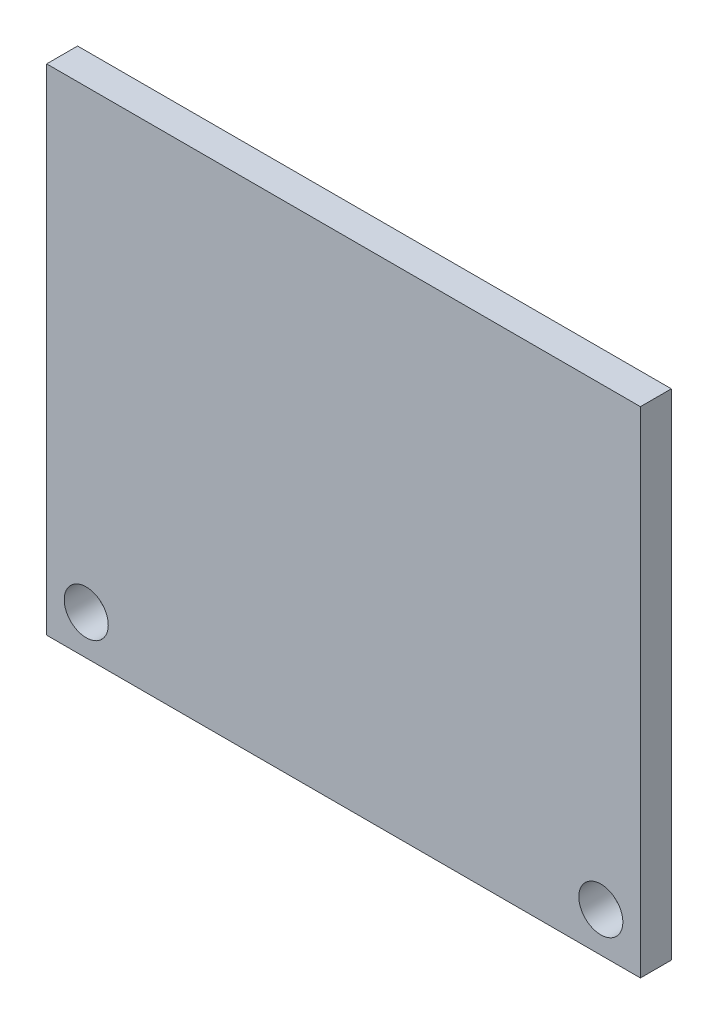
ISO-10303-21;
HEADER;
FILE_DESCRIPTION(('STEP AP214'),'2;1');
FILE_NAME('part.step','',(''),(''),'','','');
FILE_SCHEMA(('AUTOMOTIVE_DESIGN { 1 0 10303 214 1 1 1 1 }'));
ENDSEC;
DATA;
#1=APPLICATION_CONTEXT('core data for automotive mechanical design processes');
#2=APPLICATION_PROTOCOL_DEFINITION('international standard','automotive_design',2000,#1);
#3=PRODUCT_CONTEXT('',#1,'mechanical');
#4=PRODUCT('Part','Part','',(#3));
#5=PRODUCT_RELATED_PRODUCT_CATEGORY('part','',(#4));
#6=PRODUCT_DEFINITION_FORMATION('','',#4);
#7=PRODUCT_DEFINITION_CONTEXT('part definition',#1,'design');
#8=PRODUCT_DEFINITION('design','',#6,#7);
#9=PRODUCT_DEFINITION_SHAPE('','',#8);
#10=(LENGTH_UNIT() NAMED_UNIT(*) SI_UNIT(.MILLI.,.METRE.));
#11=(NAMED_UNIT(*) PLANE_ANGLE_UNIT() SI_UNIT($,.RADIAN.));
#12=(NAMED_UNIT(*) SI_UNIT($,.STERADIAN.) SOLID_ANGLE_UNIT());
#13=UNCERTAINTY_MEASURE_WITH_UNIT(LENGTH_MEASURE(1.E-05),#10,'distance_accuracy_value','');
#14=(GEOMETRIC_REPRESENTATION_CONTEXT(3) GLOBAL_UNCERTAINTY_ASSIGNED_CONTEXT((#13)) GLOBAL_UNIT_ASSIGNED_CONTEXT((#10,
#11,#12)) REPRESENTATION_CONTEXT('',''));
#15=CARTESIAN_POINT('',(0.,0.,0.));
#16=DIRECTION('',(0.,0.,1.));
#17=DIRECTION('',(1.,0.,0.));
#18=AXIS2_PLACEMENT_3D('',#15,#16,#17);
#19=CARTESIAN_POINT('',(15.24,12.7,1.5875));
#20=DIRECTION('',(-1.,0.,0.));
#21=DIRECTION('',(0.,-1.,0.));
#22=AXIS2_PLACEMENT_3D('',#19,#20,#21);
#23=PLANE('',#22);
#24=DIRECTION('',(0.,1.,0.));
#25=VECTOR('',#24,1.);
#26=CARTESIAN_POINT('',(15.24,12.7,0.));
#27=LINE('',#26,#25);
#28=CARTESIAN_POINT('',(15.24,-12.7,0.));
#29=VERTEX_POINT('',#28);
#30=CARTESIAN_POINT('',(15.24,12.7,0.));
#31=VERTEX_POINT('',#30);
#32=EDGE_CURVE('E95',#29,#31,#27,.T.);
#33=ORIENTED_EDGE('',*,*,#32,.T.);
#34=DIRECTION('',(0.,0.,-1.));
#35=VECTOR('',#34,1.);
#36=CARTESIAN_POINT('',(15.24,12.7,1.5875));
#37=LINE('',#36,#35);
#38=CARTESIAN_POINT('',(15.24,12.7,1.5875));
#39=VERTEX_POINT('',#38);
#40=EDGE_CURVE('E11',#39,#31,#37,.T.);
#41=ORIENTED_EDGE('',*,*,#40,.F.);
#42=DIRECTION('',(0.,1.,0.));
#43=VECTOR('',#42,1.);
#44=CARTESIAN_POINT('',(15.24,12.7,1.5875));
#45=LINE('',#44,#43);
#46=CARTESIAN_POINT('',(15.24,-12.7,1.5875));
#47=VERTEX_POINT('',#46);
#48=EDGE_CURVE('E83',#47,#39,#45,.T.);
#49=ORIENTED_EDGE('',*,*,#48,.F.);
#50=DIRECTION('',(0.,0.,-1.));
#51=VECTOR('',#50,1.);
#52=CARTESIAN_POINT('',(15.24,-12.7,1.5875));
#53=LINE('',#52,#51);
#54=EDGE_CURVE('E91',#47,#29,#53,.T.);
#55=ORIENTED_EDGE('',*,*,#54,.T.);
#56=EDGE_LOOP('',(#33,#41,#49,#55));
#57=FACE_BOUND('',#56,.T.);
#58=ADVANCED_FACE('F32',(#57),#23,.F.);
#59=CARTESIAN_POINT('',(-15.24,12.7,1.5875));
#60=DIRECTION('',(0.,-1.,0.));
#61=DIRECTION('',(0.,0.,-1.));
#62=AXIS2_PLACEMENT_3D('',#59,#60,#61);
#63=PLANE('',#62);
#64=DIRECTION('',(-1.,0.,0.));
#65=VECTOR('',#64,1.);
#66=CARTESIAN_POINT('',(-15.24,12.7,0.));
#67=LINE('',#66,#65);
#68=CARTESIAN_POINT('',(-15.24,12.7,0.));
#69=VERTEX_POINT('',#68);
#70=EDGE_CURVE('E87',#31,#69,#67,.T.);
#71=ORIENTED_EDGE('',*,*,#70,.T.);
#72=DIRECTION('',(0.,0.,-1.));
#73=VECTOR('',#72,1.);
#74=CARTESIAN_POINT('',(-15.24,12.7,1.5875));
#75=LINE('',#74,#73);
#76=CARTESIAN_POINT('',(-15.24,12.7,1.5875));
#77=VERTEX_POINT('',#76);
#78=EDGE_CURVE('E40',#77,#69,#75,.T.);
#79=ORIENTED_EDGE('',*,*,#78,.F.);
#80=DIRECTION('',(-1.,0.,0.));
#81=VECTOR('',#80,1.);
#82=CARTESIAN_POINT('',(-15.24,12.7,1.5875));
#83=LINE('',#82,#81);
#84=EDGE_CURVE('E78',#39,#77,#83,.T.);
#85=ORIENTED_EDGE('',*,*,#84,.F.);
#86=ORIENTED_EDGE('',*,*,#40,.T.);
#87=EDGE_LOOP('',(#71,#79,#85,#86));
#88=FACE_BOUND('',#87,.T.);
#89=ADVANCED_FACE('F86',(#88),#63,.F.);
#90=CARTESIAN_POINT('',(-15.24,12.7,1.5875));
#91=DIRECTION('',(1.,0.,0.));
#92=DIRECTION('',(0.,1.,0.));
#93=AXIS2_PLACEMENT_3D('',#90,#91,#92);
#94=PLANE('',#93);
#95=DIRECTION('',(0.,-1.,0.));
#96=VECTOR('',#95,1.);
#97=CARTESIAN_POINT('',(-15.24,12.7,0.));
#98=LINE('',#97,#96);
#99=CARTESIAN_POINT('',(-15.24,-12.7,0.));
#100=VERTEX_POINT('',#99);
#101=EDGE_CURVE('E65',#69,#100,#98,.T.);
#102=ORIENTED_EDGE('',*,*,#101,.T.);
#103=DIRECTION('',(0.,0.,-1.));
#104=VECTOR('',#103,1.);
#105=CARTESIAN_POINT('',(-15.24,-12.7,1.5875));
#106=LINE('',#105,#104);
#107=CARTESIAN_POINT('',(-15.24,-12.7,1.5875));
#108=VERTEX_POINT('',#107);
#109=EDGE_CURVE('E88',#108,#100,#106,.T.);
#110=ORIENTED_EDGE('',*,*,#109,.F.);
#111=DIRECTION('',(0.,-1.,0.));
#112=VECTOR('',#111,1.);
#113=CARTESIAN_POINT('',(-15.24,12.7,1.5875));
#114=LINE('',#113,#112);
#115=EDGE_CURVE('E81',#77,#108,#114,.T.);
#116=ORIENTED_EDGE('',*,*,#115,.F.);
#117=ORIENTED_EDGE('',*,*,#78,.T.);
#118=EDGE_LOOP('',(#102,#110,#116,#117));
#119=FACE_BOUND('',#118,.T.);
#120=ADVANCED_FACE('F89',(#119),#94,.F.);
#121=CARTESIAN_POINT('',(-15.24,-12.7,1.5875));
#122=DIRECTION('',(0.,1.,0.));
#123=DIRECTION('',(0.,0.,1.));
#124=AXIS2_PLACEMENT_3D('',#121,#122,#123);
#125=PLANE('',#124);
#126=DIRECTION('',(1.,0.,0.));
#127=VECTOR('',#126,1.);
#128=CARTESIAN_POINT('',(-15.24,-12.7,0.));
#129=LINE('',#128,#127);
#130=EDGE_CURVE('E71',#100,#29,#129,.T.);
#131=ORIENTED_EDGE('',*,*,#130,.T.);
#132=ORIENTED_EDGE('',*,*,#54,.F.);
#133=DIRECTION('',(1.,0.,0.));
#134=VECTOR('',#133,1.);
#135=CARTESIAN_POINT('',(-15.24,-12.7,1.5875));
#136=LINE('',#135,#134);
#137=EDGE_CURVE('E48',#108,#47,#136,.T.);
#138=ORIENTED_EDGE('',*,*,#137,.F.);
#139=ORIENTED_EDGE('',*,*,#109,.T.);
#140=EDGE_LOOP('',(#131,#132,#138,#139));
#141=FACE_BOUND('',#140,.T.);
#142=ADVANCED_FACE('F103',(#141),#125,.F.);
#143=CARTESIAN_POINT('',(15.24,-12.7,1.5875));
#144=DIRECTION('',(0.,0.,1.));
#145=DIRECTION('',(1.,0.,0.));
#146=AXIS2_PLACEMENT_3D('',#143,#144,#145);
#147=PLANE('',#146);
#148=CARTESIAN_POINT('',(13.208,-10.668,1.5875));
#149=DIRECTION('',(0.,0.,1.));
#150=DIRECTION('',(1.,0.,0.));
#151=AXIS2_PLACEMENT_3D('',#148,#149,#150);
#152=CIRCLE('',#151,1.13029999999999);
#153=CARTESIAN_POINT('',(14.3383,-10.668,1.5875));
#154=VERTEX_POINT('',#153);
#155=EDGE_CURVE('E117',#154,#154,#152,.T.);
#156=ORIENTED_EDGE('',*,*,#155,.F.);
#157=EDGE_LOOP('',(#156));
#158=FACE_BOUND('',#157,.T.);
#159=CARTESIAN_POINT('',(-13.208,-10.668,1.5875));
#160=DIRECTION('',(0.,0.,1.));
#161=DIRECTION('',(1.,0.,0.));
#162=AXIS2_PLACEMENT_3D('',#159,#160,#161);
#163=CIRCLE('',#162,1.13029999999999);
#164=CARTESIAN_POINT('',(-12.0777,-10.668,1.5875));
#165=VERTEX_POINT('',#164);
#166=EDGE_CURVE('E111',#165,#165,#163,.T.);
#167=ORIENTED_EDGE('',*,*,#166,.F.);
#168=EDGE_LOOP('',(#167));
#169=FACE_BOUND('',#168,.T.);
#170=ORIENTED_EDGE('',*,*,#48,.T.);
#171=ORIENTED_EDGE('',*,*,#84,.T.);
#172=ORIENTED_EDGE('',*,*,#115,.T.);
#173=ORIENTED_EDGE('',*,*,#137,.T.);
#174=EDGE_LOOP('',(#170,#171,#172,#173));
#175=FACE_BOUND('',#174,.T.);
#176=ADVANCED_FACE('F79',(#158,#169,#175),#147,.T.);
#177=CARTESIAN_POINT('',(15.24,-12.7,0.));
#178=DIRECTION('',(0.,0.,1.));
#179=DIRECTION('',(1.,0.,0.));
#180=AXIS2_PLACEMENT_3D('',#177,#178,#179);
#181=PLANE('',#180);
#182=CARTESIAN_POINT('',(13.208,-10.668,0.));
#183=DIRECTION('',(0.,0.,1.));
#184=DIRECTION('',(1.,0.,0.));
#185=AXIS2_PLACEMENT_3D('',#182,#183,#184);
#186=CIRCLE('',#185,1.13029999999999);
#187=CARTESIAN_POINT('',(14.3383,-10.668,0.));
#188=VERTEX_POINT('',#187);
#189=EDGE_CURVE('E114',#188,#188,#186,.T.);
#190=ORIENTED_EDGE('',*,*,#189,.T.);
#191=EDGE_LOOP('',(#190));
#192=FACE_BOUND('',#191,.T.);
#193=CARTESIAN_POINT('',(-13.208,-10.668,0.));
#194=DIRECTION('',(0.,0.,1.));
#195=DIRECTION('',(1.,0.,0.));
#196=AXIS2_PLACEMENT_3D('',#193,#194,#195);
#197=CIRCLE('',#196,1.13029999999999);
#198=CARTESIAN_POINT('',(-12.0777,-10.668,0.));
#199=VERTEX_POINT('',#198);
#200=EDGE_CURVE('E98',#199,#199,#197,.T.);
#201=ORIENTED_EDGE('',*,*,#200,.T.);
#202=EDGE_LOOP('',(#201));
#203=FACE_BOUND('',#202,.T.);
#204=ORIENTED_EDGE('',*,*,#32,.F.);
#205=ORIENTED_EDGE('',*,*,#130,.F.);
#206=ORIENTED_EDGE('',*,*,#101,.F.);
#207=ORIENTED_EDGE('',*,*,#70,.F.);
#208=EDGE_LOOP('',(#204,#205,#206,#207));
#209=FACE_BOUND('',#208,.T.);
#210=ADVANCED_FACE('F106',(#192,#203,#209),#181,.F.);
#211=CARTESIAN_POINT('',(-13.208,-10.668,1.5875));
#212=DIRECTION('',(0.,0.,1.));
#213=DIRECTION('',(1.,0.,0.));
#214=AXIS2_PLACEMENT_3D('',#211,#212,#213);
#215=CYLINDRICAL_SURFACE('',#214,1.13029999999999);
#216=ORIENTED_EDGE('',*,*,#200,.F.);
#217=EDGE_LOOP('',(#216));
#218=FACE_BOUND('',#217,.T.);
#219=ORIENTED_EDGE('',*,*,#166,.T.);
#220=EDGE_LOOP('',(#219));
#221=FACE_BOUND('',#220,.T.);
#222=ADVANCED_FACE('F128',(#218,#221),#215,.F.);
#223=CARTESIAN_POINT('',(13.208,-10.668,1.5875));
#224=DIRECTION('',(0.,0.,1.));
#225=DIRECTION('',(1.,0.,0.));
#226=AXIS2_PLACEMENT_3D('',#223,#224,#225);
#227=CYLINDRICAL_SURFACE('',#226,1.13029999999999);
#228=ORIENTED_EDGE('',*,*,#189,.F.);
#229=EDGE_LOOP('',(#228));
#230=FACE_BOUND('',#229,.T.);
#231=ORIENTED_EDGE('',*,*,#155,.T.);
#232=EDGE_LOOP('',(#231));
#233=FACE_BOUND('',#232,.T.);
#234=ADVANCED_FACE('F121',(#230,#233),#227,.F.);
#235=CLOSED_SHELL('',(#58,#89,#120,#142,#176,#210,#222,#234));
#236=MANIFOLD_SOLID_BREP('B2',#235);
#237=ADVANCED_BREP_SHAPE_REPRESENTATION('',(#18,#236),#14);
#238=SHAPE_DEFINITION_REPRESENTATION(#9,#237);
ENDSEC;
END-ISO-10303-21;
